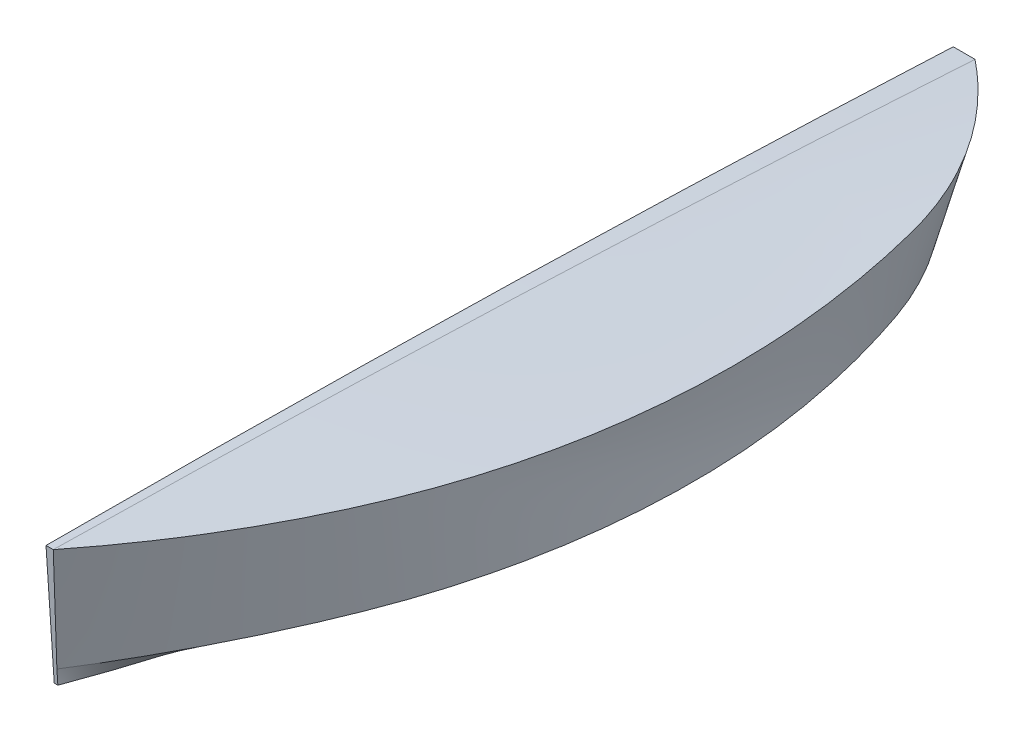
ISO-10303-21;
HEADER;
FILE_DESCRIPTION(('STEP AP214'),'2;1');
FILE_NAME('part.step','',(''),(''),'','','');
FILE_SCHEMA(('AUTOMOTIVE_DESIGN { 1 0 10303 214 1 1 1 1 }'));
ENDSEC;
DATA;
#1=APPLICATION_CONTEXT('core data for automotive mechanical design processes');
#2=APPLICATION_PROTOCOL_DEFINITION('international standard','automotive_design',2000,#1);
#3=PRODUCT_CONTEXT('',#1,'mechanical');
#4=PRODUCT('Part','Part','',(#3));
#5=PRODUCT_RELATED_PRODUCT_CATEGORY('part','',(#4));
#6=PRODUCT_DEFINITION_FORMATION('','',#4);
#7=PRODUCT_DEFINITION_CONTEXT('part definition',#1,'design');
#8=PRODUCT_DEFINITION('design','',#6,#7);
#9=PRODUCT_DEFINITION_SHAPE('','',#8);
#10=(LENGTH_UNIT() NAMED_UNIT(*) SI_UNIT(.MILLI.,.METRE.));
#11=(NAMED_UNIT(*) PLANE_ANGLE_UNIT() SI_UNIT($,.RADIAN.));
#12=(NAMED_UNIT(*) SI_UNIT($,.STERADIAN.) SOLID_ANGLE_UNIT());
#13=UNCERTAINTY_MEASURE_WITH_UNIT(LENGTH_MEASURE(1.E-05),#10,'distance_accuracy_value','');
#14=(GEOMETRIC_REPRESENTATION_CONTEXT(3) GLOBAL_UNCERTAINTY_ASSIGNED_CONTEXT((#13)) GLOBAL_UNIT_ASSIGNED_CONTEXT((#10,
#11,#12)) REPRESENTATION_CONTEXT('',''));
#15=CARTESIAN_POINT('',(0.,0.,0.));
#16=DIRECTION('',(0.,0.,1.));
#17=DIRECTION('',(1.,0.,0.));
#18=AXIS2_PLACEMENT_3D('',#15,#16,#17);
#19=CARTESIAN_POINT('',(0.,-1800.,-5400.));
#20=DIRECTION('',(0.,-0.316227766016838,-0.948683298050514));
#21=DIRECTION('',(0.,0.948683298050514,-0.316227766016838));
#22=AXIS2_PLACEMENT_3D('',#19,#20,#21);
#23=PLANE('',#22);
#24=DIRECTION('',(-1.,0.,0.));
#25=VECTOR('',#24,1.);
#26=CARTESIAN_POINT('',(25.0000000000004,-3.24744498268324E-13,-6000.));
#27=LINE('',#26,#25);
#28=CARTESIAN_POINT('',(50.0000000000008,-6.50180754144306E-13,-6000.));
#29=VERTEX_POINT('',#28);
#30=CARTESIAN_POINT('',(0.,2.22044604925032E-13,-6000.));
#31=VERTEX_POINT('',#30);
#32=EDGE_CURVE('E316',#29,#31,#27,.T.);
#33=ORIENTED_EDGE('',*,*,#32,.T.);
#34=DIRECTION('',(0.,0.948683298050514,-0.316227766016838));
#35=VECTOR('',#34,1.);
#36=CARTESIAN_POINT('',(0.,-1.33226762955019E-12,-6000.));
#37=LINE('',#36,#35);
#38=CARTESIAN_POINT('',(0.,599.999999999995,-6200.00000000001));
#39=VERTEX_POINT('',#38);
#40=EDGE_CURVE('E206',#31,#39,#37,.T.);
#41=ORIENTED_EDGE('',*,*,#40,.T.);
#42=DIRECTION('',(1.,1.89478062869369E-13,0.));
#43=VECTOR('',#42,1.);
#44=CARTESIAN_POINT('',(74.9999999999963,600.000000000009,-6200.));
#45=LINE('',#44,#43);
#46=CARTESIAN_POINT('',(149.999999999997,600.000000000009,-6200.));
#47=VERTEX_POINT('',#46);
#48=EDGE_CURVE('E202',#39,#47,#45,.T.);
#49=ORIENTED_EDGE('',*,*,#48,.T.);
#50=DIRECTION('',(-0.169977809900969,-0.93487795445562,0.311625984818573));
#51=VECTOR('',#50,1.);
#52=CARTESIAN_POINT('',(100.000000000016,324.999999999993,-6108.33333333333));
#53=LINE('',#52,#51);
#54=CARTESIAN_POINT('',(50.0000000000309,49.99999999999,-6016.66666666665));
#55=VERTEX_POINT('',#54);
#56=EDGE_CURVE('E229',#47,#55,#53,.T.);
#57=ORIENTED_EDGE('',*,*,#56,.T.);
#58=DIRECTION('',(-5.72046428286382E-13,-0.948683298050613,0.316227766016541));
#59=VECTOR('',#58,1.);
#60=CARTESIAN_POINT('',(50.0000000000158,24.9999999999947,-6008.33333333332));
#61=LINE('',#60,#59);
#62=EDGE_CURVE('E322',#55,#29,#61,.T.);
#63=ORIENTED_EDGE('',*,*,#62,.T.);
#64=EDGE_LOOP('',(#33,#41,#49,#57,#63));
#65=FACE_BOUND('',#64,.T.);
#66=ADVANCED_FACE('F149',(#65),#23,.T.);
#67=CARTESIAN_POINT('',(149.999999999993,600.000000000023,-6200.));
#68=CARTESIAN_POINT('',(150.000000000001,599.999999999996,-6200.));
#69=CARTESIAN_POINT('',(149.106811732839,602.681108900947,-6144.1757333029));
#70=CARTESIAN_POINT('',(197.516491578904,598.197985123422,-6162.45801407113));
#71=CARTESIAN_POINT('',(147.320380007706,607.971480852092,-6032.52375048213));
#72=CARTESIAN_POINT('',(289.431129098996,594.502275287073,-6083.43160458684));
#73=CARTESIAN_POINT('',(144.640369297096,615.692040401376,-5865.02308106902));
#74=CARTESIAN_POINT('',(416.991269744565,588.815559027584,-5953.88528078912));
#75=CARTESIAN_POINT('',(141.95979791314,623.198140747907,-5697.48736957176));
#76=CARTESIAN_POINT('',(533.360538181401,583.119876224195,-5814.23616846073));
#77=CARTESIAN_POINT('',(139.278467603303,630.490187616944,-5529.90422520703));
#78=CARTESIAN_POINT('',(637.738707260115,577.547592431797,-5665.45650118631));
#79=CARTESIAN_POINT('',(136.596180115054,637.568586733742,-5362.26125719148));
#80=CARTESIAN_POINT('',(729.412129406674,572.22592559489,-5508.58411665887));
#81=CARTESIAN_POINT('',(133.912735927893,644.433617817087,-5194.54599549392));
#82=CARTESIAN_POINT('',(807.754326956012,567.273618604313,-5344.71100550449));
#83=CARTESIAN_POINT('',(131.22793552132,651.085560585763,-5026.74597008316));
#84=CARTESIAN_POINT('',(872.239918090847,562.797715293745,-5174.98124258756));
#85=CARTESIAN_POINT('',(129.437030103859,655.378228362522,-4914.81438149185));
#86=CARTESIAN_POINT('',(905.703402922091,560.19331684393,-5058.71135866652));
#87=CARTESIAN_POINT('',(127.418956219151,660.133916344182,-4788.68476369762));
#88=CARTESIAN_POINT('',(937.912971300164,557.501714100532,-4926.43739786057));
#89=CARTESIAN_POINT('',(125.174310912396,665.310011641586,-4648.39443202547));
#90=CARTESIAN_POINT('',(971.108796167647,554.868400365975,-4778.65871303194));
#91=CARTESIAN_POINT('',(121.807288629767,672.733723208844,-4437.95553936118));
#92=CARTESIAN_POINT('',(1012.92658981627,552.032476510437,-4555.3217009196));
#93=CARTESIAN_POINT('',(118.44012578637,679.817204578284,-4227.5078616489));
#94=CARTESIAN_POINT('',(1046.72540256525,550.33782012681,-4330.61648120823));
#95=CARTESIAN_POINT('',(115.072736143935,686.560656930936,-4017.04600899671));
#96=CARTESIAN_POINT('',(1072.44559720857,549.805004883771,-4104.84107895654));
#97=CARTESIAN_POINT('',(111.70503346419,692.964281447832,-3806.56459151271));
#98=CARTESIAN_POINT('',(1090.06441814186,550.449853898459,-3878.29973535252));
#99=CARTESIAN_POINT('',(107.214230554167,701.049386824574,-3525.88940963626));
#100=CARTESIAN_POINT('',(1102.71495333261,552.889586564332,-3575.62621543875));
#101=CARTESIAN_POINT('',(102.722455707668,708.454965935472,-3245.15348173011));
#102=CARTESIAN_POINT('',(1099.08670951722,557.709169520172,-3272.63563429814));
#103=CARTESIAN_POINT('',(98.2293630628363,715.181148186198,-2964.3351914282));
#104=CARTESIAN_POINT('',(1079.2144200649,564.881371684892,-2970.54217829383));
#105=CARTESIAN_POINT('',(94.8587976199103,719.886000559438,-2753.67485124536));
#106=CARTESIAN_POINT('',(1056.21449502974,571.418308930371,-2744.72331679197));
#107=CARTESIAN_POINT('',(91.4873991575456,724.250982733151,-2542.9624473476));
#108=CARTESIAN_POINT('',(1025.16494651242,579.092343144727,-2519.95439298288));
#109=CARTESIAN_POINT('',(88.1150806156057,728.276008822621,-2332.19253847639));
#110=CARTESIAN_POINT('',(986.10602479763,587.874419727524,-2296.53477228871));
#111=CARTESIAN_POINT('',(84.7417549339545,731.960992943125,-2121.35968337322));
#112=CARTESIAN_POINT('',(939.11266874909,597.731091373557,-2074.75606751819));
#113=CARTESIAN_POINT('',(81.3673339899652,735.30568782464,-1910.45837437392));
#114=CARTESIAN_POINT('',(884.244613072776,608.622415707575,-1854.91184163032));
#115=CARTESIAN_POINT('',(77.991729661011,738.309846197139,-1699.48310381431));
#116=CARTESIAN_POINT('',(821.601358873148,620.503777043408,-1637.28439184472));
#117=CARTESIAN_POINT('',(75.7404791033138,740.085429259445,-1558.77994395825));
#118=CARTESIAN_POINT('',(774.708654819218,629.051117030809,-1493.86782466301));
#119=CARTESIAN_POINT('',(72.5718348356098,742.424097933956,-1360.73967722678));
#120=CARTESIAN_POINT('',(705.167591224336,641.494289823813,-1293.35018184661));
#121=CARTESIAN_POINT('',(68.4799654284802,745.068680330929,-1104.99783928122));
#122=CARTESIAN_POINT('',(608.538995631559,658.516337542358,-1037.73118865215));
#123=CARTESIAN_POINT('',(62.3279113847367,747.910926095733,-720.494461547309));
#124=CARTESIAN_POINT('',(443.128791911839,686.69486355459,-663.904036697253));
#125=CARTESIAN_POINT('',(56.1663229735762,749.619845153842,-335.395185849829));
#126=CARTESIAN_POINT('',(257.861938722375,717.206907712732,-300.40232417151));
#127=CARTESIAN_POINT('',(52.0554325047914,750.000000404304,-78.464531550817));
#128=CARTESIAN_POINT('',(121.383386039124,738.884432348937,-65.486970664048));
#129=CARTESIAN_POINT('',(49.9999999999775,750.000000000028,50.0000000000341));
#130=CARTESIAN_POINT('',(49.9999999999856,750.000000000007,50.0000000000256));
#131=B_SPLINE_SURFACE_WITH_KNOTS('',3,1,((#67,#68),(#69,#70),(#71,#72),(#73,#74),(#75,#76),(#77,
#78),(#79,#80),(#81,#82),(#83,#84),(#85,#86),(#87,#88),(#89,#90),(#91,#92),(#93,#94),(#95,#96),
(#97,#98),(#99,#100),(#101,#102),(#103,#104),(#105,#106),(#107,#108),(#109,#110),(#111,#112),
(#113,#114),(#115,#116),(#117,#118),(#119,#120),(#121,#122),(#123,#124),(#125,#126),(#127,#128),
(#129,#130)),.UNSPECIFIED.,.F.,.F.,.F.,(4,1,1,1,1,1,1,1,2,1,1,1,1,1,1,1,1,1,1,1,1,1,1,2,1,1,1,
4),(2,2),(0.,0.0269244961815453,0.0538489923630905,0.0807734885446358,0.107697984726181,
0.134622480907726,0.161546977089272,0.188471473270817,0.215395969452362,0.24913111109093,
0.282866252729497,0.316601394368064,0.350336536006632,0.384071677645199,0.417806819283767,
0.485277102560901,0.519012244199469,0.552747385838036,0.586482527476603,0.620217669115171,
0.653952810753738,0.687687952392306,0.721423094030873,0.75515823566944,0.81636867675208,
0.87757911783472,0.93878955891736,1.),(0.,1.),.UNSPECIFIED.);
#132=CARTESIAN_POINT('',(149.999999999993,600.000000000023,-6200.));
#133=CARTESIAN_POINT('',(149.106811732839,602.681108900947,-6144.1757333029));
#134=CARTESIAN_POINT('',(147.320380007706,607.971480852092,-6032.52375048213));
#135=CARTESIAN_POINT('',(144.640369297096,615.692040401376,-5865.02308106902));
#136=CARTESIAN_POINT('',(141.95979791314,623.198140747907,-5697.48736957176));
#137=CARTESIAN_POINT('',(139.278467603303,630.490187616944,-5529.90422520703));
#138=CARTESIAN_POINT('',(136.596180115054,637.568586733742,-5362.26125719148));
#139=CARTESIAN_POINT('',(133.912735927893,644.433617817087,-5194.54599549392));
#140=CARTESIAN_POINT('',(131.22793552132,651.085560585763,-5026.74597008316));
#141=CARTESIAN_POINT('',(129.437030103859,655.378228362522,-4914.81438149185));
#142=CARTESIAN_POINT('',(127.418956219151,660.133916344182,-4788.68476369762));
#143=CARTESIAN_POINT('',(125.174310912396,665.310011641586,-4648.39443202547));
#144=CARTESIAN_POINT('',(121.807288629767,672.733723208844,-4437.95553936118));
#145=CARTESIAN_POINT('',(118.44012578637,679.817204578284,-4227.5078616489));
#146=CARTESIAN_POINT('',(115.072736143935,686.560656930936,-4017.04600899671));
#147=CARTESIAN_POINT('',(111.70503346419,692.964281447832,-3806.56459151271));
#148=CARTESIAN_POINT('',(107.214230554167,701.049386824574,-3525.88940963626));
#149=CARTESIAN_POINT('',(102.722455707668,708.454965935472,-3245.15348173011));
#150=CARTESIAN_POINT('',(98.2293630628363,715.181148186198,-2964.3351914282));
#151=CARTESIAN_POINT('',(94.8587976199103,719.886000559438,-2753.67485124536));
#152=CARTESIAN_POINT('',(91.4873991575456,724.250982733151,-2542.9624473476));
#153=CARTESIAN_POINT('',(88.1150806156057,728.276008822621,-2332.19253847639));
#154=CARTESIAN_POINT('',(84.7417549339545,731.960992943125,-2121.35968337322));
#155=CARTESIAN_POINT('',(81.3673339899652,735.30568782464,-1910.45837437392));
#156=CARTESIAN_POINT('',(77.991729661011,738.309846197139,-1699.48310381431));
#157=CARTESIAN_POINT('',(75.7404791033138,740.085429259445,-1558.77994395825));
#158=CARTESIAN_POINT('',(72.5718348356098,742.424097933956,-1360.73967722678));
#159=CARTESIAN_POINT('',(68.4799654284802,745.068680330929,-1104.99783928122));
#160=CARTESIAN_POINT('',(62.3279113847367,747.910926095733,-720.494461547309));
#161=CARTESIAN_POINT('',(56.1663229735762,749.619845153842,-335.395185849829));
#162=CARTESIAN_POINT('',(52.0554325047914,750.000000404304,-78.464531550817));
#163=CARTESIAN_POINT('',(49.9999999999775,750.000000000028,50.0000000000341));
#164=B_SPLINE_CURVE_WITH_KNOTS('',3,(#132,#133,#134,#135,#136,#137,#138,#139,#140,#141,#142,
#143,#144,#145,#146,#147,#148,#149,#150,#151,#152,#153,#154,#155,#156,#157,#158,#159,#160,#161,
#162,#163),.UNSPECIFIED.,.F.,.F.,(4,1,1,1,1,1,1,1,2,1,1,1,1,1,1,1,1,1,1,1,1,1,1,2,1,1,1,4),(0.,
0.0269244961815453,0.0538489923630905,0.0807734885446358,0.107697984726181,0.134622480907726,
0.161546977089272,0.188471473270817,0.215395969452362,0.24913111109093,0.282866252729497,
0.316601394368064,0.350336536006632,0.384071677645199,0.417806819283767,0.485277102560901,
0.519012244199469,0.552747385838036,0.586482527476603,0.620217669115171,0.653952810753738,
0.687687952392306,0.721423094030873,0.75515823566944,0.81636867675208,0.87757911783472,
0.93878955891736,1.),.UNSPECIFIED.);
#165=CARTESIAN_POINT('',(49.9999999999853,750.000000000015,50.0000000000201));
#166=VERTEX_POINT('',#165);
#167=EDGE_CURVE('E167',#47,#166,#164,.T.);
#168=CARTESIAN_POINT('',(49.9999999999856,750.000000000007,50.0000000000256));
#169=CARTESIAN_POINT('',(121.383386039124,738.884432348937,-65.486970664048));
#170=CARTESIAN_POINT('',(257.861938722375,717.206907712732,-300.40232417151));
#171=CARTESIAN_POINT('',(443.128791911839,686.69486355459,-663.904036697253));
#172=CARTESIAN_POINT('',(608.538995631559,658.516337542358,-1037.73118865215));
#173=CARTESIAN_POINT('',(705.167591224336,641.494289823813,-1293.35018184661));
#174=CARTESIAN_POINT('',(774.708654819218,629.051117030809,-1493.86782466301));
#175=CARTESIAN_POINT('',(821.601358873148,620.503777043408,-1637.28439184472));
#176=CARTESIAN_POINT('',(884.244613072776,608.622415707575,-1854.91184163032));
#177=CARTESIAN_POINT('',(939.11266874909,597.731091373557,-2074.75606751819));
#178=CARTESIAN_POINT('',(986.10602479763,587.874419727524,-2296.53477228871));
#179=CARTESIAN_POINT('',(1025.16494651242,579.092343144727,-2519.95439298288));
#180=CARTESIAN_POINT('',(1056.21449502974,571.418308930371,-2744.72331679197));
#181=CARTESIAN_POINT('',(1079.2144200649,564.881371684892,-2970.54217829383));
#182=CARTESIAN_POINT('',(1099.08670951722,557.709169520172,-3272.63563429814));
#183=CARTESIAN_POINT('',(1102.71495333261,552.889586564332,-3575.62621543875));
#184=CARTESIAN_POINT('',(1090.06441814186,550.449853898459,-3878.29973535252));
#185=CARTESIAN_POINT('',(1072.44559720857,549.805004883771,-4104.84107895654));
#186=CARTESIAN_POINT('',(1046.72540256525,550.33782012681,-4330.61648120823));
#187=CARTESIAN_POINT('',(1012.92658981627,552.032476510437,-4555.3217009196));
#188=CARTESIAN_POINT('',(971.108796167647,554.868400365975,-4778.65871303194));
#189=CARTESIAN_POINT('',(937.912971300164,557.501714100532,-4926.43739786057));
#190=CARTESIAN_POINT('',(905.703402922091,560.19331684393,-5058.71135866652));
#191=CARTESIAN_POINT('',(872.239918090847,562.797715293745,-5174.98124258756));
#192=CARTESIAN_POINT('',(807.754326956012,567.273618604313,-5344.71100550449));
#193=CARTESIAN_POINT('',(729.412129406674,572.22592559489,-5508.58411665887));
#194=CARTESIAN_POINT('',(637.738707260115,577.547592431797,-5665.45650118631));
#195=CARTESIAN_POINT('',(533.360538181401,583.119876224195,-5814.23616846073));
#196=CARTESIAN_POINT('',(416.991269744565,588.815559027584,-5953.88528078912));
#197=CARTESIAN_POINT('',(289.431129098996,594.502275287073,-6083.43160458684));
#198=CARTESIAN_POINT('',(197.516491578904,598.197985123422,-6162.45801407113));
#199=CARTESIAN_POINT('',(150.000000000001,599.999999999996,-6200.));
#200=B_SPLINE_CURVE_WITH_KNOTS('',3,(#168,#169,#170,#171,#172,#173,#174,#175,#176,#177,#178,
#179,#180,#181,#182,#183,#184,#185,#186,#187,#188,#189,#190,#191,#192,#193,#194,#195,#196,#197,
#198,#199),.UNSPECIFIED.,.F.,.F.,(4,1,1,1,2,1,1,1,1,1,1,1,1,1,1,1,1,1,1,2,1,1,1,1,1,1,1,4),(0.,
0.0612104410826401,0.12242088216528,0.18363132324792,0.24484176433056,0.278576905969127,
0.312312047607694,0.346047189246262,0.379782330884829,0.413517472523397,0.447252614161964,
0.480987755800531,0.514722897439099,0.582193180716233,0.615928322354801,0.649663463993368,
0.683398605631936,0.717133747270503,0.75086888890907,0.784604030547638,0.811528526729183,
0.838453022910728,0.865377519092274,0.892302015273819,0.919226511455364,0.946151007636909,
0.973075503818455,1.),.UNSPECIFIED.);
#201=EDGE_CURVE('E222',#166,#47,#200,.T.);
#202=ORIENTED_EDGE('',*,*,#167,.T.);
#203=ORIENTED_EDGE('',*,*,#201,.T.);
#204=EDGE_LOOP('',(#202,#203));
#205=FACE_BOUND('',#204,.T.);
#206=ADVANCED_FACE('F252',(#205),#131,.T.);
#207=CARTESIAN_POINT('',(0.,750.,50.0000000000078));
#208=CARTESIAN_POINT('',(49.9999999999775,750.000000000028,50.0000000000341));
#209=CARTESIAN_POINT('',(0.,750.,-991.966623479098));
#210=CARTESIAN_POINT('',(66.6714647475137,750.000003279075,-991.96654672083));
#211=CARTESIAN_POINT('',(0.,737.498200518213,-2034.0832469551));
#212=CARTESIAN_POINT('',(83.3453288820163,737.498205897465,-2034.08305512709));
#213=CARTESIAN_POINT('',(0.,687.491002591064,-4117.71649391952));
#214=CARTESIAN_POINT('',(116.683459606932,687.491009810097,-4117.71622543403));
#215=CARTESIAN_POINT('',(0.,649.985606217811,-5159.23303107013));
#216=CARTESIAN_POINT('',(133.347724816646,649.985613175388,-5159.23280104101));
#217=CARTESIAN_POINT('',(0.,599.999999999994,-6200.00000000001));
#218=CARTESIAN_POINT('',(149.999999999993,600.000000000023,-6200.));
#219=B_SPLINE_SURFACE_WITH_KNOTS('',3,1,((#207,#208),(#209,#210),(#211,#212),(#213,#214),(#215,
#216),(#217,#218)),.UNSPECIFIED.,.F.,.F.,.F.,(4,2,4),(2,2),(0.,0.5,1.),(0.,1.),.UNSPECIFIED.);
#220=CARTESIAN_POINT('',(0.,750.,50.0000000000078));
#221=CARTESIAN_POINT('',(0.,750.,-991.966623479098));
#222=CARTESIAN_POINT('',(0.,737.498200518213,-2034.0832469551));
#223=CARTESIAN_POINT('',(0.,687.491002591064,-4117.71649391952));
#224=CARTESIAN_POINT('',(0.,649.985606217811,-5159.23303107013));
#225=CARTESIAN_POINT('',(0.,599.999999999994,-6200.00000000001));
#226=B_SPLINE_CURVE_WITH_KNOTS('',3,(#220,#221,#222,#223,#224,#225),.UNSPECIFIED.,.F.,.F.,(4,2,
4),(0.,0.5,1.),.UNSPECIFIED.);
#227=CARTESIAN_POINT('',(0.,750.,50.0000000000039));
#228=VERTEX_POINT('',#227);
#229=EDGE_CURVE('E195',#228,#39,#226,.T.);
#230=DIRECTION('',(-1.,0.,0.));
#231=VECTOR('',#230,1.);
#232=CARTESIAN_POINT('',(50.,750.,50.));
#233=LINE('',#232,#231);
#234=EDGE_CURVE('E199',#166,#228,#233,.T.);
#235=ORIENTED_EDGE('',*,*,#229,.F.);
#236=ORIENTED_EDGE('',*,*,#234,.F.);
#237=ORIENTED_EDGE('',*,*,#167,.F.);
#238=ORIENTED_EDGE('',*,*,#48,.F.);
#239=EDGE_LOOP('',(#235,#236,#237,#238));
#240=FACE_BOUND('',#239,.T.);
#241=ADVANCED_FACE('F197',(#240),#219,.F.);
#242=CARTESIAN_POINT('',(0.,712.494601554639,-3075.89987043731));
#243=DIRECTION('',(1.,0.,0.));
#244=DIRECTION('',(0.,0.,-1.));
#245=AXIS2_PLACEMENT_3D('',#242,#243,#244);
#246=PLANE('',#245);
#247=ORIENTED_EDGE('',*,*,#40,.F.);
#248=CARTESIAN_POINT('',(0.,-100.000000000001,-6.66666666665794));
#249=CARTESIAN_POINT('',(0.,-116.657229675049,-151.662976734989));
#250=CARTESIAN_POINT('',(0.,-147.897291578008,-441.89396303339));
#251=CARTESIAN_POINT('',(0.,-188.523920799557,-877.844786753142));
#252=CARTESIAN_POINT('',(0.,-222.906815096736,-1314.28920053198));
#253=CARTESIAN_POINT('',(0.,-251.04086529497,-1751.11615150992));
#254=CARTESIAN_POINT('',(0.,-272.920962219683,-2188.21458682697));
#255=CARTESIAN_POINT('',(0.,-288.546911965466,-2625.47346265691));
#256=CARTESIAN_POINT('',(0.,-297.918520626909,-3062.78173517351));
#257=CARTESIAN_POINT('',(0.,-300.000000000001,-3354.27969606341));
#258=CARTESIAN_POINT('',(0.,-300.000000000001,-3605.31691367129));
#259=CARTESIAN_POINT('',(0.,-296.850369908496,-3815.89307510061));
#260=CARTESIAN_POINT('',(0.,-282.698162922622,-4131.32456087689));
#261=CARTESIAN_POINT('',(0.,-259.13932251403,-4446.06353165765));
#262=CARTESIAN_POINT('',(0.,-226.206829410583,-4759.8521719919));
#263=CARTESIAN_POINT('',(0.,-183.933664340147,-5072.43266642864));
#264=CARTESIAN_POINT('',(0.,-132.36399044108,-5383.54933039593));
#265=CARTESIAN_POINT('',(0.,-71.541970851739,-5692.94647932187));
#266=CARTESIAN_POINT('',(0.,-24.8629533534565,-5897.89613822848));
#267=CARTESIAN_POINT('',(0.,0.,-6000.00000000001));
#268=B_SPLINE_CURVE_WITH_KNOTS('',3,(#248,#249,#250,#251,#252,#253,#254,#255,#256,#257,#258,
#259,#260,#261,#262,#263,#264,#265,#266,#267),.UNSPECIFIED.,.F.,.F.,(4,1,1,1,1,1,1,1,2,1,1,1,1,
1,1,1,4),(0.,0.0725591135595607,0.145118227119121,0.217677340678682,0.290236454238243,
0.362795567797804,0.435354681357364,0.507913794916925,0.580472908476486,0.632913794916925,
0.685354681357364,0.737795567797804,0.790236454238243,0.842677340678682,0.895118227119121,
0.947559113559561,1.),.UNSPECIFIED.);
#269=CARTESIAN_POINT('',(0.,-100.000000000001,-6.6666666666623));
#270=VERTEX_POINT('',#269);
#271=EDGE_CURVE('E205',#31,#270,#268,.F.);
#272=ORIENTED_EDGE('',*,*,#271,.T.);
#273=DIRECTION('',(0.,-0.997785157856609,-0.0665190105237739));
#274=VECTOR('',#273,1.);
#275=CARTESIAN_POINT('',(0.,750.,50.));
#276=LINE('',#275,#274);
#277=EDGE_CURVE('E209',#228,#270,#276,.T.);
#278=ORIENTED_EDGE('',*,*,#277,.F.);
#279=ORIENTED_EDGE('',*,*,#229,.T.);
#280=EDGE_LOOP('',(#247,#272,#278,#279));
#281=FACE_BOUND('',#280,.T.);
#282=ADVANCED_FACE('F210',(#281),#246,.F.);
#283=CARTESIAN_POINT('',(24.9999999999986,-99.9999999999979,-6.66666666666771));
#284=CARTESIAN_POINT('',(0.,-100.000000000001,-6.66666666665794));
#285=CARTESIAN_POINT('',(55.9863078882404,-116.389314585945,-149.330854281922));
#286=CARTESIAN_POINT('',(0.,-116.657229675049,-151.662976734989));
#287=CARTESIAN_POINT('',(114.210139267762,-147.252245202406,-435.693804966754));
#288=CARTESIAN_POINT('',(0.,-147.897291578008,-441.89396303339));
#289=CARTESIAN_POINT('',(190.167127115013,-187.66374237976,-868.008728112565));
#290=CARTESIAN_POINT('',(0.,-188.523920799557,-877.844786753142));
#291=CARTESIAN_POINT('',(254.65019462557,-222.074771642481,-1302.7446146343));
#292=CARTESIAN_POINT('',(0.,-222.906815096736,-1314.28920053198));
#293=CARTESIAN_POINT('',(307.550771475069,-250.379787281512,-1739.54619320235));
#294=CARTESIAN_POINT('',(0.,-251.04086529497,-1751.11615150992));
#295=CARTESIAN_POINT('',(348.79914975745,-272.49335637271,-2178.04560657294));
#296=CARTESIAN_POINT('',(0.,-272.920962219683,-2188.21458682697));
#297=CARTESIAN_POINT('',(378.314161108678,-288.34295104548,-2617.8704596531));
#298=CARTESIAN_POINT('',(0.,-288.546911965466,-2625.47346265691));
#299=CARTESIAN_POINT('',(396.055672053137,-297.877995370288,-3058.64003995302));
#300=CARTESIAN_POINT('',(0.,-297.918520626909,-3062.78173517351));
#301=CARTESIAN_POINT('',(399.999999999998,-300.000000000002,-3352.86066044084));
#302=CARTESIAN_POINT('',(0.,-300.000000000001,-3354.27969606341));
#303=CARTESIAN_POINT('',(399.999999999987,-299.999999999999,-3606.34249811235));
#304=CARTESIAN_POINT('',(0.,-300.000000000001,-3605.31691367129));
#305=CARTESIAN_POINT('',(396.276166833579,-296.790773230169,-3819.08558604981));
#306=CARTESIAN_POINT('',(0.,-296.850369908496,-3815.89307510061));
#307=CARTESIAN_POINT('',(379.503089034757,-282.34471265216,-4137.668784284));
#308=CARTESIAN_POINT('',(0.,-282.698162922622,-4131.32456087689));
#309=CARTESIAN_POINT('',(351.635133675837,-258.355304304889,-4455.0265526402));
#310=CARTESIAN_POINT('',(0.,-259.13932251403,-4446.06353165765));
#311=CARTESIAN_POINT('',(312.771520681781,-224.935245806982,-4770.47773158231));
#312=CARTESIAN_POINT('',(0.,-226.206829410583,-4759.8521719919));
#313=CARTESIAN_POINT('',(263.107219145148,-182.279560459317,-5083.37566136019));
#314=CARTESIAN_POINT('',(0.,-183.933664340147,-5072.43266642864));
#315=CARTESIAN_POINT('',(202.841307098898,-130.604598481716,-5393.1000878273));
#316=CARTESIAN_POINT('',(0.,-132.36399044108,-5383.54933039593));
#317=CARTESIAN_POINT('',(132.253548352816,-70.194735150591,-5699.08311725302));
#318=CARTESIAN_POINT('',(0.,-71.541970851739,-5692.94647932187));
#319=CARTESIAN_POINT('',(78.4964765305917,-24.2966827376557,-5900.2216228907));
#320=CARTESIAN_POINT('',(0.,-24.8629533534565,-5897.89613822848));
#321=CARTESIAN_POINT('',(50.0000000000008,-6.49488996536648E-13,-6000.));
#322=CARTESIAN_POINT('',(0.,0.,-6000.00000000001));
#323=B_SPLINE_SURFACE_WITH_KNOTS('',3,1,((#283,#284),(#285,#286),(#287,#288),(#289,#290),(#291,
#292),(#293,#294),(#295,#296),(#297,#298),(#299,#300),(#301,#302),(#303,#304),(#305,#306),(#307,
#308),(#309,#310),(#311,#312),(#313,#314),(#315,#316),(#317,#318),(#319,#320),(#321,#322)),
.UNSPECIFIED.,.F.,.F.,.F.,(4,1,1,1,1,1,1,1,2,1,1,1,1,1,1,1,4),(2,2),(0.,0.0725591135595607,
0.145118227119121,0.217677340678682,0.290236454238243,0.362795567797804,0.435354681357364,
0.507913794916925,0.580472908476486,0.632913794916925,0.685354681357364,0.737795567797804,
0.790236454238243,0.842677340678682,0.895118227119121,0.947559113559561,1.),(0.,1.),.UNSPECIFIED.);
#324=CARTESIAN_POINT('',(50.0000000000008,-6.49488996536648E-13,-6000.));
#325=CARTESIAN_POINT('',(78.4964765305917,-24.2966827376557,-5900.2216228907));
#326=CARTESIAN_POINT('',(132.253548352816,-70.194735150591,-5699.08311725302));
#327=CARTESIAN_POINT('',(202.841307098898,-130.604598481716,-5393.1000878273));
#328=CARTESIAN_POINT('',(263.107219145148,-182.279560459317,-5083.37566136019));
#329=CARTESIAN_POINT('',(312.771520681781,-224.935245806982,-4770.47773158231));
#330=CARTESIAN_POINT('',(351.635133675837,-258.355304304889,-4455.0265526402));
#331=CARTESIAN_POINT('',(379.503089034757,-282.34471265216,-4137.668784284));
#332=CARTESIAN_POINT('',(396.276166833579,-296.790773230169,-3819.08558604981));
#333=CARTESIAN_POINT('',(399.999999999987,-299.999999999999,-3606.34249811235));
#334=CARTESIAN_POINT('',(399.999999999998,-300.000000000002,-3352.86066044084));
#335=CARTESIAN_POINT('',(396.055672053137,-297.877995370288,-3058.64003995302));
#336=CARTESIAN_POINT('',(378.314161108678,-288.34295104548,-2617.8704596531));
#337=CARTESIAN_POINT('',(348.79914975745,-272.49335637271,-2178.04560657294));
#338=CARTESIAN_POINT('',(307.550771475069,-250.379787281512,-1739.54619320235));
#339=CARTESIAN_POINT('',(254.65019462557,-222.074771642481,-1302.7446146343));
#340=CARTESIAN_POINT('',(190.167127115013,-187.66374237976,-868.008728112565));
#341=CARTESIAN_POINT('',(114.210139267762,-147.252245202406,-435.693804966754));
#342=CARTESIAN_POINT('',(55.9863078882404,-116.389314585945,-149.330854281922));
#343=CARTESIAN_POINT('',(24.9999999999986,-99.9999999999979,-6.66666666666771));
#344=B_SPLINE_CURVE_WITH_KNOTS('',3,(#324,#325,#326,#327,#328,#329,#330,#331,#332,#333,#334,
#335,#336,#337,#338,#339,#340,#341,#342,#343),.UNSPECIFIED.,.F.,.F.,(4,1,1,1,1,1,1,1,2,1,1,1,1,
1,1,1,4),(0.,0.0524408864404393,0.104881772880879,0.157322659321318,0.209763545761757,
0.262204432202196,0.314645318642636,0.367086205083075,0.419527091523514,0.492086205083075,
0.564645318642636,0.637204432202196,0.709763545761757,0.782322659321318,0.854881772880879,
0.927440886440439,1.),.UNSPECIFIED.);
#345=CARTESIAN_POINT('',(24.999999999999,-99.9999999999985,-6.66666666666716));
#346=VERTEX_POINT('',#345);
#347=EDGE_CURVE('E400',#29,#346,#344,.T.);
#348=DIRECTION('',(1.,0.,0.));
#349=VECTOR('',#348,1.);
#350=CARTESIAN_POINT('',(0.,-100.,-6.66666666666667));
#351=LINE('',#350,#349);
#352=EDGE_CURVE('E216',#270,#346,#351,.T.);
#353=ORIENTED_EDGE('',*,*,#347,.T.);
#354=ORIENTED_EDGE('',*,*,#352,.F.);
#355=ORIENTED_EDGE('',*,*,#271,.F.);
#356=ORIENTED_EDGE('',*,*,#32,.F.);
#357=EDGE_LOOP('',(#353,#354,#355,#356));
#358=FACE_BOUND('',#357,.T.);
#359=ADVANCED_FACE('F327',(#358),#323,.F.);
#360=CARTESIAN_POINT('',(50.0000000000008,-6.49488996536648E-13,-6000.));
#361=CARTESIAN_POINT('',(50.0000000000309,49.9999999999901,-6016.66666666665));
#362=CARTESIAN_POINT('',(62.9109845099906,-11.008171278062,-5954.79310995143));
#363=CARTESIAN_POINT('',(94.3072329361938,47.5785589318615,-5986.24497466005));
#364=CARTESIAN_POINT('',(88.0690114417731,-32.4714580832306,-5864.05483260339));
#365=CARTESIAN_POINT('',(180.371108666921,42.5295347419174,-5921.70279398296));
#366=CARTESIAN_POINT('',(123.788147514968,-62.9794387732966,-5726.98938740721));
#367=CARTESIAN_POINT('',(300.897393828332,34.490908228264,-5814.48646090045));
#368=CARTESIAN_POINT('',(157.463301203798,-91.7726876808512,-5588.98137561546));
#369=CARTESIAN_POINT('',(412.010078957396,26.147608518093,-5697.6447386175));
#370=CARTESIAN_POINT('',(189.071547359012,-118.825565570114,-5450.05068754806));
#371=CARTESIAN_POINT('',(512.93323203451,17.6619688611804,-5572.01950327398));
#372=CARTESIAN_POINT('',(218.589960831363,-144.112433205303,-5310.21721352495));
#373=CARTESIAN_POINT('',(602.974347747803,9.19454998582765,-5438.5194507221));
#374=CARTESIAN_POINT('',(245.991352548284,-167.605599784668,-5169.50240482196));
#375=CARTESIAN_POINT('',(681.521096252757,0.899878967805993,-5298.10683599394));
#376=CARTESIAN_POINT('',(271.24853343721,-189.277374506457,-5027.92771271494));
#377=CARTESIAN_POINT('',(748.05091807076,-7.07735156490205,-5151.79253828953));
#378=CARTESIAN_POINT('',(286.639734966758,-202.493260107105,-4932.98784788662));
#379=CARTESIAN_POINT('',(784.103888826459,-12.0960556102677,-5051.01598423144));
#380=CARTESIAN_POINT('',(302.708941213815,-216.295562014492,-4828.61874496036));
#381=CARTESIAN_POINT('',(818.954499474314,-17.391429970521,-4939.16861578645));
#382=CARTESIAN_POINT('',(319.122566932348,-230.399077031989,-4714.88248439761));
#383=CARTESIAN_POINT('',(854.789396574742,-22.8357828651291,-4816.7528521832));
#384=CARTESIAN_POINT('',(340.53442396738,-248.80961009775,-4543.61763670182));
#385=CARTESIAN_POINT('',(902.174896293574,-30.0034725397442,-4631.23431194161));
#386=CARTESIAN_POINT('',(358.726420016185,-264.460774616483,-4371.65596078515));
#387=CARTESIAN_POINT('',(943.102197722376,-36.1284136336214,-4444.20232472078));
#388=CARTESIAN_POINT('',(373.680249683223,-277.332379419777,-4198.96281419858));
#389=CARTESIAN_POINT('',(977.485551718098,-41.175194722407,-4256.03999457546));
#390=CARTESIAN_POINT('',(385.377607572954,-287.40423333922,-4025.50355449309));
#391=CARTESIAN_POINT('',(1005.29301178808,-45.1173061815647,-4067.13887742093));
#392=CARTESIAN_POINT('',(393.783187278629,-294.64392748172,-3851.24117692428));
#393=CARTESIAN_POINT('',(1026.49952435322,-47.9371855668834,-3877.88671846004));
#394=CARTESIAN_POINT('',(398.861682393497,-299.019052954184,-3676.13867674776));
#395=CARTESIAN_POINT('',(1041.13421102089,-49.6267668557266,-3688.67087433592));
#396=CARTESIAN_POINT('',(399.999999999993,-299.999999999999,-3558.81557812715));
#397=CARTESIAN_POINT('',(1046.53179307906,-50.0000000000088,-3562.80320538093));
#398=CARTESIAN_POINT('',(399.999999999998,-300.000000000002,-3416.6231709318));
#399=CARTESIAN_POINT('',(1050.45718795672,-50.0000000000114,-3410.97031965467));
#400=CARTESIAN_POINT('',(398.73215478145,-299.318009788245,-3249.54863968508));
#401=CARTESIAN_POINT('',(1050.75241038872,-49.8058710862714,-3233.15327085356));
#402=CARTESIAN_POINT('',(392.992906803359,-296.232212806584,-2998.2097230347));
#403=CARTESIAN_POINT('',(1038.35999111136,-48.9386376790061,-2967.58546278098));
#404=CARTESIAN_POINT('',(383.382234180375,-291.066763132141,-2746.37918615478));
#405=CARTESIAN_POINT('',(1013.31177606854,-47.5058463064731,-2703.5959015418));
#406=CARTESIAN_POINT('',(369.893079641553,-283.820645539349,-2494.30239792861));
#407=CARTESIAN_POINT('',(975.687394471361,-45.5211945191253,-2441.60794970742));
#408=CARTESIAN_POINT('',(352.518385915946,-274.492844802643,-2242.22472723947));
#409=CARTESIAN_POINT('',(925.650042851566,-43.0019994776781,-2182.0311907102));
#410=CARTESIAN_POINT('',(331.273681138297,-263.097258727393,-1990.39423945531));
#411=CARTESIAN_POINT('',(863.26961139811,-39.9689654632792,-1925.28832645491));
#412=CARTESIAN_POINT('',(306.174493443347,-249.647785118968,-1739.05899994407));
#413=CARTESIAN_POINT('',(788.699585275939,-36.44588816592,-1671.78296472554));
#414=CARTESIAN_POINT('',(286.90072895696,-239.33207307624,-1571.99436909021));
#415=CARTESIAN_POINT('',(730.898156828105,-33.7887307484691,-1505.22339523623));
#416=CARTESIAN_POINT('',(261.317848227535,-225.648998222937,-1364.21819591202));
#417=CARTESIAN_POINT('',(653.892083375431,-30.2978590636395,-1299.35930110596));
#418=CARTESIAN_POINT('',(227.831563994603,-207.755605140383,-1115.70236597659));
#419=CARTESIAN_POINT('',(556.489620142135,-25.7812260225357,-1054.95199608728));
#420=CARTESIAN_POINT('',(169.096623477012,-176.445684982863,-744.180427235344));
#421=CARTESIAN_POINT('',(395.054613246151,-18.0661123534292,-695.244696207634));
#422=CARTESIAN_POINT('',(101.921484406667,-140.734597565717,-374.259930477775));
#423=CARTESIAN_POINT('',(218.611078367812,-9.48531987744374,-342.94579024525));
#424=CARTESIAN_POINT('',(51.5584122920658,-114.047306814604,-128.944361952737));
#425=CARTESIAN_POINT('',(91.1398824402362,-3.24002862007155,-113.377858640605));
#426=CARTESIAN_POINT('',(24.9999999999986,-99.9999999999979,-6.66666666666771));
#427=CARTESIAN_POINT('',(25.0000000000163,-1.00163615472209E-11,-2.59795658530141E-11));
#428=B_SPLINE_SURFACE_WITH_KNOTS('',3,1,((#360,#361),(#362,#363),(#364,#365),(#366,#367),(#368,
#369),(#370,#371),(#372,#373),(#374,#375),(#376,#377),(#378,#379),(#380,#381),(#382,#383),(#384,
#385),(#386,#387),(#388,#389),(#390,#391),(#392,#393),(#394,#395),(#396,#397),(#398,#399),(#400,
#401),(#402,#403),(#404,#405),(#406,#407),(#408,#409),(#410,#411),(#412,#413),(#414,#415),(#416,
#417),(#418,#419),(#420,#421),(#422,#423),(#424,#425),(#426,#427)),.UNSPECIFIED.,.F.,.F.,.F.,(4,
1,1,1,1,1,1,1,2,1,1,1,1,1,1,1,2,1,1,1,1,1,1,1,2,1,1,1,4),(2,2),(0.,0.0243003925741152,
0.0486007851482304,0.0729011777223455,0.0972015702964607,0.121501962870576,0.145802355444691,
0.170102748018806,0.194403140592921,0.223378892794812,0.252354644996703,0.281330397198594,
0.310306149400484,0.339281901602375,0.368257653804266,0.397233406006157,0.426209158208048,
0.46728511827489,0.508361078341732,0.549437038408574,0.590512998475417,0.631588958542259,
0.672664918609101,0.713740878675944,0.754816838742786,0.816112629057089,0.877408419371393,
0.938704209685696,1.),(0.,1.),.UNSPECIFIED.);
#429=CARTESIAN_POINT('',(50.0000000000309,49.9999999999901,-6016.66666666665));
#430=CARTESIAN_POINT('',(94.3072329361938,47.5785589318615,-5986.24497466005));
#431=CARTESIAN_POINT('',(180.371108666921,42.5295347419174,-5921.70279398296));
#432=CARTESIAN_POINT('',(300.897393828332,34.490908228264,-5814.48646090045));
#433=CARTESIAN_POINT('',(412.010078957396,26.147608518093,-5697.6447386175));
#434=CARTESIAN_POINT('',(512.93323203451,17.6619688611804,-5572.01950327398));
#435=CARTESIAN_POINT('',(602.974347747803,9.19454998582765,-5438.5194507221));
#436=CARTESIAN_POINT('',(681.521096252757,0.899878967805993,-5298.10683599394));
#437=CARTESIAN_POINT('',(748.05091807076,-7.07735156490205,-5151.79253828953));
#438=CARTESIAN_POINT('',(784.103888826459,-12.0960556102677,-5051.01598423144));
#439=CARTESIAN_POINT('',(818.954499474314,-17.391429970521,-4939.16861578645));
#440=CARTESIAN_POINT('',(854.789396574742,-22.8357828651291,-4816.7528521832));
#441=CARTESIAN_POINT('',(902.174896293574,-30.0034725397442,-4631.23431194161));
#442=CARTESIAN_POINT('',(943.102197722376,-36.1284136336214,-4444.20232472078));
#443=CARTESIAN_POINT('',(977.485551718098,-41.175194722407,-4256.03999457546));
#444=CARTESIAN_POINT('',(1005.29301178808,-45.1173061815647,-4067.13887742093));
#445=CARTESIAN_POINT('',(1026.49952435322,-47.9371855668834,-3877.88671846004));
#446=CARTESIAN_POINT('',(1041.13421102089,-49.6267668557266,-3688.67087433592));
#447=CARTESIAN_POINT('',(1046.53179307906,-50.0000000000088,-3562.80320538093));
#448=CARTESIAN_POINT('',(1050.45718795672,-50.0000000000114,-3410.97031965467));
#449=CARTESIAN_POINT('',(1050.75241038872,-49.8058710862714,-3233.15327085356));
#450=CARTESIAN_POINT('',(1038.35999111136,-48.9386376790061,-2967.58546278098));
#451=CARTESIAN_POINT('',(1013.31177606854,-47.5058463064731,-2703.5959015418));
#452=CARTESIAN_POINT('',(975.687394471361,-45.5211945191253,-2441.60794970742));
#453=CARTESIAN_POINT('',(925.650042851566,-43.0019994776781,-2182.0311907102));
#454=CARTESIAN_POINT('',(863.26961139811,-39.9689654632792,-1925.28832645491));
#455=CARTESIAN_POINT('',(788.699585275939,-36.44588816592,-1671.78296472554));
#456=CARTESIAN_POINT('',(730.898156828105,-33.7887307484691,-1505.22339523623));
#457=CARTESIAN_POINT('',(653.892083375431,-30.2978590636395,-1299.35930110596));
#458=CARTESIAN_POINT('',(556.489620142135,-25.7812260225357,-1054.95199608728));
#459=CARTESIAN_POINT('',(395.054613246151,-18.0661123534292,-695.244696207634));
#460=CARTESIAN_POINT('',(218.611078367812,-9.48531987744374,-342.94579024525));
#461=CARTESIAN_POINT('',(91.1398824402362,-3.24002862007155,-113.377858640605));
#462=CARTESIAN_POINT('',(25.0000000000163,-1.00163615472209E-11,-2.59795658530141E-11));
#463=B_SPLINE_CURVE_WITH_KNOTS('',3,(#429,#430,#431,#432,#433,#434,#435,#436,#437,#438,#439,
#440,#441,#442,#443,#444,#445,#446,#447,#448,#449,#450,#451,#452,#453,#454,#455,#456,#457,#458,
#459,#460,#461,#462),.UNSPECIFIED.,.F.,.F.,(4,1,1,1,1,1,1,1,2,1,1,1,1,1,1,1,2,1,1,1,1,1,1,1,2,1,
1,1,4),(0.,0.0243003925741152,0.0486007851482304,0.0729011777223455,0.0972015702964607,
0.121501962870576,0.145802355444691,0.170102748018806,0.194403140592921,0.223378892794812,
0.252354644996703,0.281330397198594,0.310306149400484,0.339281901602375,0.368257653804266,
0.397233406006157,0.426209158208048,0.46728511827489,0.508361078341732,0.549437038408574,
0.590512998475417,0.631588958542259,0.672664918609101,0.713740878675944,0.754816838742786,
0.816112629057089,0.877408419371393,0.938704209685696,1.),.UNSPECIFIED.);
#464=CARTESIAN_POINT('',(25.0000000000081,-9.28600886536924E-12,-1.32766628213467E-11));
#465=VERTEX_POINT('',#464);
#466=EDGE_CURVE('E243',#55,#465,#463,.T.);
#467=DIRECTION('',(0.,0.997785157856609,0.0665190105237739));
#468=VECTOR('',#467,1.);
#469=CARTESIAN_POINT('',(25.,-100.,-6.66666666666667));
#470=LINE('',#469,#468);
#471=EDGE_CURVE('E160',#346,#465,#470,.T.);
#472=ORIENTED_EDGE('',*,*,#347,.F.);
#473=ORIENTED_EDGE('',*,*,#62,.F.);
#474=ORIENTED_EDGE('',*,*,#466,.T.);
#475=ORIENTED_EDGE('',*,*,#471,.F.);
#476=EDGE_LOOP('',(#472,#473,#474,#475));
#477=FACE_BOUND('',#476,.T.);
#478=ADVANCED_FACE('F338',(#477),#428,.F.);
#479=CARTESIAN_POINT('',(49.9999999999856,750.000000000007,50.0000000000256));
#480=CARTESIAN_POINT('',(25.0000000000163,-1.00163615472209E-11,-2.59795658530141E-11));
#481=CARTESIAN_POINT('',(87.9284339943321,744.093918804417,-11.3621766504031));
#482=CARTESIAN_POINT('',(56.3935766899762,-1.53789337400417,-53.8152831371488));
#483=CARTESIAN_POINT('',(162.258201418257,732.399143975361,-135.610317691977));
#484=CARTESIAN_POINT('',(118.099081583259,-4.56086362411839,-162.078227034152));
#485=CARTESIAN_POINT('',(268.009724619461,715.427021409777,-324.745749074792));
#486=CARTESIAN_POINT('',(207.75073896892,-8.94637650024748,-327.027266398736));
#487=CARTESIAN_POINT('',(367.094030631447,699.21848726908,-514.742519519189));
#488=CARTESIAN_POINT('',(294.796295551381,-13.190232681287,-495.248030693475));
#489=CARTESIAN_POINT('',(458.900573773235,683.926449663474,-703.786098928006));
#490=CARTESIAN_POINT('',(379.510664523667,-17.2978328565664,-667.551550998806));
#491=CARTESIAN_POINT('',(543.132795531646,669.654247150168,-890.290273604494));
#492=CARTESIAN_POINT('',(462.15769217171,-21.272852925358,-844.893023806007));
#493=CARTESIAN_POINT('',(619.745274782889,656.456775109053,-1072.99571886542));
#494=CARTESIAN_POINT('',(542.979104488658,-25.1171961750697,-1028.44015944702));
#495=CARTESIAN_POINT('',(688.941795087838,644.346446807203,-1250.96651802793));
#496=CARTESIAN_POINT('',(622.222452919831,-28.8307126843105,-1219.68285264948));
#497=CARTESIAN_POINT('',(730.37674767265,636.983546481149,-1366.03932933871));
#498=CARTESIAN_POINT('',(674.182023482765,-31.2176511557694,-1353.60138816317));
#499=CARTESIAN_POINT('',(760.691839092144,631.559184222818,-1453.45114559468));
#500=CARTESIAN_POINT('',(714.067069311571,-33.0257368156257,-1460.22802760529));
#501=CARTESIAN_POINT('',(780.795652232679,627.932905580517,-1512.94179860186));
#502=CARTESIAN_POINT('',(741.982064072859,-34.298897448382,-1537.35002821001));
#503=CARTESIAN_POINT('',(808.092669348666,622.935274808143,-1597.70738072679));
#504=CARTESIAN_POINT('',(782.792814168941,-36.1838083699064,-1658.64502640478));
#505=CARTESIAN_POINT('',(833.136826494629,618.281346940838,-1679.29441574815));
#506=CARTESIAN_POINT('',(822.137511759011,-38.0257431256566,-1785.43511462256));
#507=CARTESIAN_POINT('',(856.35222155562,613.902019181798,-1758.64440879354));
#508=CARTESIAN_POINT('',(859.509620853902,-39.8002499153198,-1917.1771610545));
#509=CARTESIAN_POINT('',(878.038345430579,609.747908559034,-1836.46751360286));
#510=CARTESIAN_POINT('',(894.427093797486,-41.4832945347107,-2053.1821978282));
#511=CARTESIAN_POINT('',(898.42233033287,605.781029454848,-1913.3497341906));
#512=CARTESIAN_POINT('',(926.377829438117,-43.0492832467371,-2192.40704115216));
#513=CARTESIAN_POINT('',(917.675365233154,601.971567003929,-1989.79860034276));
#514=CARTESIAN_POINT('',(954.927843147106,-44.4754914831577,-2333.61584758294));
#515=CARTESIAN_POINT('',(935.932771022816,598.294917974124,-2066.28574390817));
#516=CARTESIAN_POINT('',(979.755456829488,-45.7432644205564,-2475.41211903971));
#517=CARTESIAN_POINT('',(953.303394590806,594.730159732687,-2143.27621065883));
#518=CARTESIAN_POINT('',(1000.68311957761,-46.8405066322655,-2616.38563124326));
#519=CARTESIAN_POINT('',(969.87673367966,591.258653082539,-2221.25626934873));
#520=CARTESIAN_POINT('',(1017.66850723171,-47.7622767917966,-2755.25417783266));
#521=CARTESIAN_POINT('',(985.727699923703,587.86292280409,-2300.77160698839));
#522=CARTESIAN_POINT('',(1030.81595361349,-48.5103642140398,-2890.90397384045));
#523=CARTESIAN_POINT('',(1000.92009520295,584.525695279458,-2382.45996483571));
#524=CARTESIAN_POINT('',(1040.35340983651,-49.0925367479584,-3022.55238591231));
#525=CARTESIAN_POINT('',(1015.50676007909,581.228306579213,-2467.13697174646));
#526=CARTESIAN_POINT('',(1046.56442834596,-49.5199650264415,-3149.56305323492));
#527=CARTESIAN_POINT('',(1029.53462383349,577.949462055211,-2555.86340261864));
#528=CARTESIAN_POINT('',(1049.77400469425,-49.8068323759996,-3271.70868294761));
#529=CARTESIAN_POINT('',(1043.04812190559,574.660981420768,-2650.21083683978));
#530=CARTESIAN_POINT('',(1050.30713443381,-49.9673221231434,-3388.76198218968));
#531=CARTESIAN_POINT('',(1051.74447407637,572.436171629418,-2718.41476541253));
#532=CARTESIAN_POINT('',(1049.09993368604,-50.0000000000114,-3463.4684348771));
#533=CARTESIAN_POINT('',(1060.63839839572,570.083761705591,-2793.53193128125));
#534=CARTESIAN_POINT('',(1047.13723624721,-50.0000000000087,-3539.38487774027));
#535=CARTESIAN_POINT('',(1069.3271822267,567.696830062975,-2873.09208001954));
#536=CARTESIAN_POINT('',(1044.35392346817,-49.8547449930774,-3614.76971631206));
#537=CARTESIAN_POINT('',(1080.4709006814,564.317862152917,-2997.35860916048));
#538=CARTESIAN_POINT('',(1038.35046471374,-49.2878081894603,-3720.73295621197));
#539=CARTESIAN_POINT('',(1089.45395800167,561.180073174717,-3126.61861708247));
#540=CARTESIAN_POINT('',(1030.75440868503,-48.4221855369806,-3821.43511856726));
#541=CARTESIAN_POINT('',(1095.97291044646,558.331584300365,-3260.70023726974));
#542=CARTESIAN_POINT('',(1021.71701184028,-47.2907106173067,-3918.18000900964));
#543=CARTESIAN_POINT('',(1099.72431427472,555.820516701855,-3399.43160320651));
#544=CARTESIAN_POINT('',(1011.32567061011,-45.9138170526657,-4011.90314553346));
#545=CARTESIAN_POINT('',(1100.4098573007,553.697373051958,-3542.32980812847));
#546=CARTESIAN_POINT('',(999.625570444304,-44.3042672413608,-4103.33574803155));
#547=CARTESIAN_POINT('',(1097.7644911712,552.009527358772,-3688.80705384372));
#548=CARTESIAN_POINT('',(986.632194846723,-42.4687645797435,-4193.06533536205));
#549=CARTESIAN_POINT('',(1091.58074308087,550.798702664193,-3838.01536579842));
#550=CARTESIAN_POINT('',(972.336337788949,-40.4093412202447,-4281.59410012087));
#551=CARTESIAN_POINT('',(1081.72643087053,550.096122858286,-3988.95435706204));
#552=CARTESIAN_POINT('',(956.704132443109,-38.1237205009846,-4369.367467391));
#553=CARTESIAN_POINT('',(1068.17720272046,549.919292172471,-4140.48110165087));
#554=CARTESIAN_POINT('',(939.674081021818,-35.6055624014075,-4456.80125944996));
#555=CARTESIAN_POINT('',(1051.02232236339,550.269404215822,-4291.39273893865));
#556=CARTESIAN_POINT('',(921.15960750422,-32.8441856685138,-4544.30279481353));
#557=CARTESIAN_POINT('',(1030.44357413441,551.131348992621,-4440.53428141488));
#558=CARTESIAN_POINT('',(901.043588036136,-29.8240580681023,-4632.29100295887));
#559=CARTESIAN_POINT('',(1006.72600927317,552.47502662695,-4586.81930421506));
#560=CARTESIAN_POINT('',(879.170525455469,-26.5235756732172,-4721.22008555707));
#561=CARTESIAN_POINT('',(980.210440465202,554.259159814782,-4729.41365892823));
#562=CARTESIAN_POINT('',(855.330579371254,-22.9136395186612,-4811.60326840892));
#563=CARTESIAN_POINT('',(951.270309634206,556.434891966686,-4867.55407904188));
#564=CARTESIAN_POINT('',(829.242307669325,-18.9544124911977,-4904.05783212498));
#565=CARTESIAN_POINT('',(930.60975284334,558.112009854987,-4956.42928165659));
#566=CARTESIAN_POINT('',(810.099267946541,-16.0459222415445,-4967.58804158534));
#567=CARTESIAN_POINT('',(904.607310849175,560.284912123813,-5063.21264344596));
#568=CARTESIAN_POINT('',(785.347925247503,-12.2850806644849,-5047.02345160843));
#569=CARTESIAN_POINT('',(868.662596204133,563.066346926083,-5186.35470281751));
#570=CARTESIAN_POINT('',(752.01243884343,-7.61003346971993,-5141.32396089098));
#571=CARTESIAN_POINT('',(800.6879341445,567.742475655384,-5361.31538541309));
#572=CARTESIAN_POINT('',(689.352445241043,0.00378512934359147,-5282.16233740736));
#573=CARTESIAN_POINT('',(719.815012716252,572.805213817238,-5526.52699615866));
#574=CARTESIAN_POINT('',(613.701711241797,8.11545245139783,-5420.81305300193));
#575=CARTESIAN_POINT('',(642.47832718269,577.25167292715,-5656.01954387156));
#576=CARTESIAN_POINT('',(539.786701834738,15.1724963513481,-5533.08340790417));
#577=CARTESIAN_POINT('',(575.056751419375,580.89015142669,-5754.63817249302));
#578=CARTESIAN_POINT('',(474.280089998817,20.9078090602926,-5620.01725407383));
#579=CARTESIAN_POINT('',(504.052331710899,584.5648630006,-5849.90850215193));
#580=CARTESIAN_POINT('',(404.631874230203,26.6686822358726,-5704.71857100921));
#581=CARTESIAN_POINT('',(427.851607503407,588.266962586007,-5940.10934447205));
#582=CARTESIAN_POINT('',(328.942753835799,32.4159694629062,-5785.60607998841));
#583=CARTESIAN_POINT('',(346.767297574005,591.943664605466,-6025.12131113379));
#584=CARTESIAN_POINT('',(247.744296363304,38.0379646459254,-5861.79604243858));
#585=CARTESIAN_POINT('',(283.581572336229,594.675529560217,-6086.2492375801));
#586=CARTESIAN_POINT('',(184.265552572577,42.1631158587334,-5916.38731059123));
#587=CARTESIAN_POINT('',(218.092654377957,597.368770178255,-6144.70950475561));
#588=CARTESIAN_POINT('',(118.391372708096,46.1692053366725,-5968.2391110193));
#589=CARTESIAN_POINT('',(172.939574802559,599.130039830739,-6181.87582530116));
#590=CARTESIAN_POINT('',(73.015487765921,48.742177211561,-6000.86405310231));
#591=CARTESIAN_POINT('',(150.000000000001,599.999999999996,-6200.));
#592=CARTESIAN_POINT('',(50.0000000000309,49.9999999999901,-6016.66666666665));
#593=B_SPLINE_SURFACE_WITH_KNOTS('',3,1,((#479,#480),(#481,#482),(#483,#484),(#485,#486),(#487,
#488),(#489,#490),(#491,#492),(#493,#494),(#495,#496),(#497,#498),(#499,#500),(#501,#502),(#503,
#504),(#505,#506),(#507,#508),(#509,#510),(#511,#512),(#513,#514),(#515,#516),(#517,#518),(#519,
#520),(#521,#522),(#523,#524),(#525,#526),(#527,#528),(#529,#530),(#531,#532),(#533,#534),(#535,
#536),(#537,#538),(#539,#540),(#541,#542),(#543,#544),(#545,#546),(#547,#548),(#549,#550),(#551,
#552),(#553,#554),(#555,#556),(#557,#558),(#559,#560),(#561,#562),(#563,#564),(#565,#566),(#567,
#568),(#569,#570),(#571,#572),(#573,#574),(#575,#576),(#577,#578),(#579,#580),(#581,#582),(#583,
#584),(#585,#586),(#587,#588),(#589,#590),(#591,#592)),.UNSPECIFIED.,.F.,.F.,.F.,(4,1,1,1,1,1,1,
1,2,1,1,1,1,1,1,1,1,1,1,1,1,1,1,1,2,1,1,1,1,1,1,1,1,1,1,1,1,1,1,1,2,1,1,1,1,1,1,1,1,1,1,4),(2,
2),(0.,0.0303637203687842,0.0607274407375683,0.0910911611063525,0.121454881475137,
0.151818601843921,0.182182322212705,0.212546042581489,0.242909762950273,0.259453606295266,
0.275997449640259,0.292541292985252,0.309085136330245,0.325628979675238,0.342172823020231,
0.358716666365223,0.375260509710216,0.391804353055209,0.408348196400202,0.424892039745195,
0.441435883090188,0.457979726435181,0.474523569780173,0.491067413125166,0.507611256470159,
0.525447263367384,0.543283270264608,0.561119277161833,0.578955284059058,0.596791290956282,
0.614627297853507,0.632463304750731,0.650299311647956,0.668135318545181,0.685971325442405,
0.70380733233963,0.721643339236854,0.739479346134079,0.757315353031304,0.775151359928528,
0.792987366825753,0.818863945972534,0.844740525119315,0.870617104266096,0.896493683412876,
0.909431972986267,0.922370262559657,0.948246841706438,0.961185131279829,0.974123420853219,
0.98706171042661,1.),(0.,1.),.UNSPECIFIED.);
#594=DIRECTION('',(0.0332411247657267,0.9972337429718,0.0664822495314534));
#595=VECTOR('',#594,1.);
#596=CARTESIAN_POINT('',(50.,750.,50.));
#597=LINE('',#596,#595);
#598=EDGE_CURVE('E12',#465,#166,#597,.T.);
#599=ORIENTED_EDGE('',*,*,#201,.F.);
#600=ORIENTED_EDGE('',*,*,#598,.F.);
#601=ORIENTED_EDGE('',*,*,#466,.F.);
#602=ORIENTED_EDGE('',*,*,#56,.F.);
#603=EDGE_LOOP('',(#599,#600,#601,#602));
#604=FACE_BOUND('',#603,.T.);
#605=ADVANCED_FACE('F349',(#604),#593,.F.);
#606=CARTESIAN_POINT('',(0.,0.,0.));
#607=DIRECTION('',(0.,-0.0665190105237739,0.997785157856609));
#608=DIRECTION('',(0.,-0.997785157856609,-0.0665190105237739));
#609=AXIS2_PLACEMENT_3D('',#606,#607,#608);
#610=PLANE('',#609);
#611=ORIENTED_EDGE('',*,*,#234,.T.);
#612=ORIENTED_EDGE('',*,*,#277,.T.);
#613=ORIENTED_EDGE('',*,*,#352,.T.);
#614=ORIENTED_EDGE('',*,*,#471,.T.);
#615=ORIENTED_EDGE('',*,*,#598,.T.);
#616=EDGE_LOOP('',(#611,#612,#613,#614,#615));
#617=FACE_BOUND('',#616,.T.);
#618=ADVANCED_FACE('F218',(#617),#610,.T.);
#619=CLOSED_SHELL('',(#66,#206,#241,#282,#359,#478,#605,#618));
#620=MANIFOLD_SOLID_BREP('B2',#619);
#621=ADVANCED_BREP_SHAPE_REPRESENTATION('',(#18,#620),#14);
#622=SHAPE_DEFINITION_REPRESENTATION(#9,#621);
ENDSEC;
END-ISO-10303-21;
